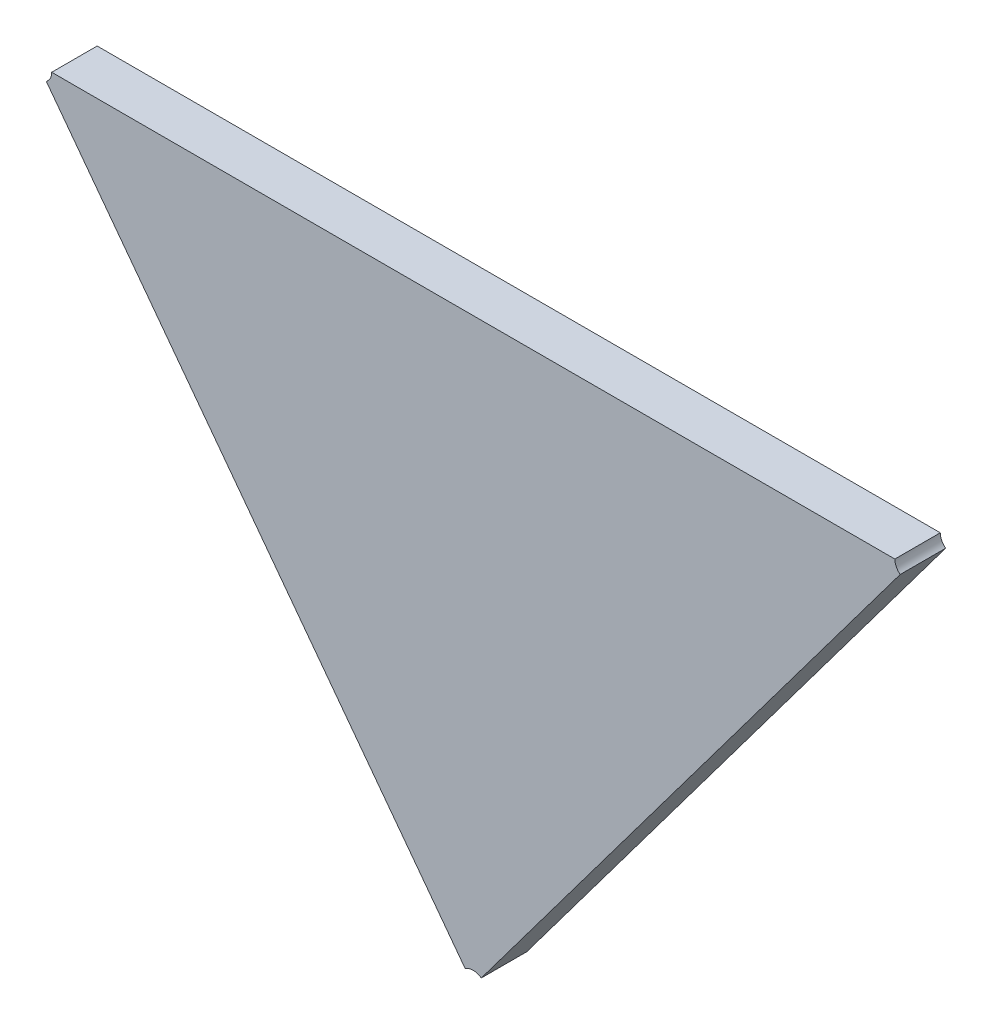
ISO-10303-21;
HEADER;
FILE_DESCRIPTION(('STEP AP214'),'2;1');
FILE_NAME('part.step','',(''),(''),'','','');
FILE_SCHEMA(('AUTOMOTIVE_DESIGN { 1 0 10303 214 1 1 1 1 }'));
ENDSEC;
DATA;
#1=APPLICATION_CONTEXT('core data for automotive mechanical design processes');
#2=APPLICATION_PROTOCOL_DEFINITION('international standard','automotive_design',2000,#1);
#3=PRODUCT_CONTEXT('',#1,'mechanical');
#4=PRODUCT('Part','Part','',(#3));
#5=PRODUCT_RELATED_PRODUCT_CATEGORY('part','',(#4));
#6=PRODUCT_DEFINITION_FORMATION('','',#4);
#7=PRODUCT_DEFINITION_CONTEXT('part definition',#1,'design');
#8=PRODUCT_DEFINITION('design','',#6,#7);
#9=PRODUCT_DEFINITION_SHAPE('','',#8);
#10=(LENGTH_UNIT() NAMED_UNIT(*) SI_UNIT(.MILLI.,.METRE.));
#11=(NAMED_UNIT(*) PLANE_ANGLE_UNIT() SI_UNIT($,.RADIAN.));
#12=(NAMED_UNIT(*) SI_UNIT($,.STERADIAN.) SOLID_ANGLE_UNIT());
#13=UNCERTAINTY_MEASURE_WITH_UNIT(LENGTH_MEASURE(1.E-05),#10,'distance_accuracy_value','');
#14=(GEOMETRIC_REPRESENTATION_CONTEXT(3) GLOBAL_UNCERTAINTY_ASSIGNED_CONTEXT((#13)) GLOBAL_UNIT_ASSIGNED_CONTEXT((#10,
#11,#12)) REPRESENTATION_CONTEXT('',''));
#15=CARTESIAN_POINT('',(0.,0.,0.));
#16=DIRECTION('',(0.,0.,1.));
#17=DIRECTION('',(1.,0.,0.));
#18=AXIS2_PLACEMENT_3D('',#15,#16,#17);
#19=CARTESIAN_POINT('',(-1.34299335690274,-1.32449342974732,0.0042));
#20=DIRECTION('',(0.,0.,1.));
#21=DIRECTION('',(1.,0.,0.));
#22=AXIS2_PLACEMENT_3D('',#19,#20,#21);
#23=PLANE('',#22);
#24=CARTESIAN_POINT('',(-1.37552796514819,-1.31090066755203,0.0042));
#25=DIRECTION('',(0.,0.,-1.));
#26=DIRECTION('',(1.,0.,0.));
#27=AXIS2_PLACEMENT_3D('',#24,#25,#26);
#28=CIRCLE('',#27,0.000999999999999994);
#29=CARTESIAN_POINT('',(-1.37452796514819,-1.31090066755203,0.0042));
#30=VERTEX_POINT('',#29);
#31=CARTESIAN_POINT('',(-1.37492823832534,-1.31170087236203,0.0042));
#32=VERTEX_POINT('',#31);
#33=EDGE_CURVE('E11',#30,#32,#28,.T.);
#34=ORIENTED_EDGE('',*,*,#33,.T.);
#35=DIRECTION('',(0.599726822848932,-0.800204810005242,0.));
#36=VECTOR('',#35,1.);
#37=CARTESIAN_POINT('',(-1.37492823832534,-1.31170087236203,0.0042));
#38=LINE('',#37,#36);
#39=CARTESIAN_POINT('',(-1.34359308372559,-1.3535108106167,0.0042));
#40=VERTEX_POINT('',#39);
#41=EDGE_CURVE('E114',#32,#40,#38,.T.);
#42=ORIENTED_EDGE('',*,*,#41,.T.);
#43=CARTESIAN_POINT('',(-1.34299335690274,-1.35431101542671,0.0042));
#44=DIRECTION('',(0.,0.,-1.));
#45=DIRECTION('',(-0.599726822847329,0.800204810006444,0.));
#46=AXIS2_PLACEMENT_3D('',#43,#44,#45);
#47=CIRCLE('',#46,0.00100000000000002);
#48=CARTESIAN_POINT('',(-1.34239363007989,-1.3535108106167,0.0042));
#49=VERTEX_POINT('',#48);
#50=EDGE_CURVE('E90',#40,#49,#47,.T.);
#51=ORIENTED_EDGE('',*,*,#50,.T.);
#52=DIRECTION('',(0.599726822848933,0.800204810005241,0.));
#53=VECTOR('',#52,1.);
#54=CARTESIAN_POINT('',(-1.34239363007989,-1.3535108106167,0.0042));
#55=LINE('',#54,#53);
#56=CARTESIAN_POINT('',(-1.31105847548013,-1.31170087236203,0.0042));
#57=VERTEX_POINT('',#56);
#58=EDGE_CURVE('E102',#49,#57,#55,.T.);
#59=ORIENTED_EDGE('',*,*,#58,.T.);
#60=CARTESIAN_POINT('',(-1.31045874865729,-1.31090066755203,0.0042));
#61=DIRECTION('',(0.,0.,-1.));
#62=DIRECTION('',(-0.599726822845659,-0.800204810007695,0.));
#63=AXIS2_PLACEMENT_3D('',#60,#61,#62);
#64=CIRCLE('',#63,0.00100000000000001);
#65=CARTESIAN_POINT('',(-1.31145874865729,-1.31090066755203,0.0042));
#66=VERTEX_POINT('',#65);
#67=EDGE_CURVE('E77',#57,#66,#64,.T.);
#68=ORIENTED_EDGE('',*,*,#67,.T.);
#69=DIRECTION('',(-1.,0.,0.));
#70=VECTOR('',#69,1.);
#71=CARTESIAN_POINT('',(-1.31145874865729,-1.31090066755203,0.0042));
#72=LINE('',#71,#70);
#73=EDGE_CURVE('E110',#66,#30,#72,.T.);
#74=ORIENTED_EDGE('',*,*,#73,.T.);
#75=EDGE_LOOP('',(#34,#42,#51,#59,#68,#74));
#76=FACE_BOUND('',#75,.T.);
#77=ADVANCED_FACE('F17',(#76),#23,.T.);
#78=CARTESIAN_POINT('',(-1.31045874865729,-1.31090066755203,0.0008));
#79=DIRECTION('',(0.,1.,0.));
#80=DIRECTION('',(-1.,0.,0.));
#81=AXIS2_PLACEMENT_3D('',#78,#79,#80);
#82=PLANE('',#81);
#83=DIRECTION('',(0.,0.,1.));
#84=VECTOR('',#83,1.);
#85=CARTESIAN_POINT('',(-1.37452796514819,-1.31090066755203,0.0008));
#86=LINE('',#85,#84);
#87=CARTESIAN_POINT('',(-1.37452796514819,-1.31090066755203,0.0008));
#88=VERTEX_POINT('',#87);
#89=EDGE_CURVE('E24',#88,#30,#86,.T.);
#90=ORIENTED_EDGE('',*,*,#89,.T.);
#91=ORIENTED_EDGE('',*,*,#73,.F.);
#92=DIRECTION('',(0.,0.,-1.));
#93=VECTOR('',#92,1.);
#94=CARTESIAN_POINT('',(-1.31145874865729,-1.31090066755203,0.0042));
#95=LINE('',#94,#93);
#96=CARTESIAN_POINT('',(-1.31145874865729,-1.31090066755203,0.0008));
#97=VERTEX_POINT('',#96);
#98=EDGE_CURVE('E104',#66,#97,#95,.T.);
#99=ORIENTED_EDGE('',*,*,#98,.T.);
#100=DIRECTION('',(-1.,0.,0.));
#101=VECTOR('',#100,1.);
#102=CARTESIAN_POINT('',(-1.31145874865729,-1.31090066755203,0.0008));
#103=LINE('',#102,#101);
#104=EDGE_CURVE('E99',#97,#88,#103,.T.);
#105=ORIENTED_EDGE('',*,*,#104,.T.);
#106=EDGE_LOOP('',(#90,#91,#99,#105));
#107=FACE_BOUND('',#106,.T.);
#108=ADVANCED_FACE('F120',(#107),#82,.T.);
#109=CARTESIAN_POINT('',(-1.34299335690274,-1.35431101542671,0.0008));
#110=DIRECTION('',(0.800204810005241,-0.599726822848934,0.));
#111=DIRECTION('',(0.599726822848934,0.800204810005241,0.));
#112=AXIS2_PLACEMENT_3D('',#109,#110,#111);
#113=PLANE('',#112);
#114=DIRECTION('',(0.,0.,-1.));
#115=VECTOR('',#114,1.);
#116=CARTESIAN_POINT('',(-1.34239363007989,-1.3535108106167,0.0042));
#117=LINE('',#116,#115);
#118=CARTESIAN_POINT('',(-1.34239363007989,-1.3535108106167,0.0008));
#119=VERTEX_POINT('',#118);
#120=EDGE_CURVE('E112',#49,#119,#117,.T.);
#121=ORIENTED_EDGE('',*,*,#120,.T.);
#122=DIRECTION('',(0.599726822848936,0.800204810005239,0.));
#123=VECTOR('',#122,1.);
#124=CARTESIAN_POINT('',(-1.34239363007989,-1.3535108106167,0.0008));
#125=LINE('',#124,#123);
#126=CARTESIAN_POINT('',(-1.31105847548013,-1.31170087236203,0.0008));
#127=VERTEX_POINT('',#126);
#128=EDGE_CURVE('E85',#119,#127,#125,.T.);
#129=ORIENTED_EDGE('',*,*,#128,.T.);
#130=DIRECTION('',(0.,0.,1.));
#131=VECTOR('',#130,1.);
#132=CARTESIAN_POINT('',(-1.31105847548013,-1.31170087236203,0.0008));
#133=LINE('',#132,#131);
#134=EDGE_CURVE('E96',#127,#57,#133,.T.);
#135=ORIENTED_EDGE('',*,*,#134,.T.);
#136=ORIENTED_EDGE('',*,*,#58,.F.);
#137=EDGE_LOOP('',(#121,#129,#135,#136));
#138=FACE_BOUND('',#137,.T.);
#139=ADVANCED_FACE('F127',(#138),#113,.T.);
#140=CARTESIAN_POINT('',(-1.3321500302078,-1.32718186406158,0.0008));
#141=DIRECTION('',(0.,0.,1.));
#142=DIRECTION('',(1.,0.,0.));
#143=AXIS2_PLACEMENT_3D('',#140,#141,#142);
#144=PLANE('',#143);
#145=CARTESIAN_POINT('',(-1.37552796514819,-1.31090066755203,0.0008));
#146=DIRECTION('',(0.,0.,1.));
#147=DIRECTION('',(0.599726822852127,-0.800204810002848,0.));
#148=AXIS2_PLACEMENT_3D('',#145,#146,#147);
#149=CIRCLE('',#148,0.000999999999999994);
#150=CARTESIAN_POINT('',(-1.37492823832534,-1.31170087236203,0.0008));
#151=VERTEX_POINT('',#150);
#152=EDGE_CURVE('E107',#151,#88,#149,.T.);
#153=ORIENTED_EDGE('',*,*,#152,.T.);
#154=ORIENTED_EDGE('',*,*,#104,.F.);
#155=CARTESIAN_POINT('',(-1.31045874865729,-1.31090066755203,0.0008));
#156=DIRECTION('',(0.,0.,1.));
#157=DIRECTION('',(-1.,0.,0.));
#158=AXIS2_PLACEMENT_3D('',#155,#156,#157);
#159=CIRCLE('',#158,0.00100000000000001);
#160=EDGE_CURVE('E78',#97,#127,#159,.T.);
#161=ORIENTED_EDGE('',*,*,#160,.T.);
#162=ORIENTED_EDGE('',*,*,#128,.F.);
#163=CARTESIAN_POINT('',(-1.34299335690274,-1.35431101542671,0.0008));
#164=DIRECTION('',(0.,0.,1.));
#165=DIRECTION('',(0.599726822847436,0.800204810006364,0.));
#166=AXIS2_PLACEMENT_3D('',#163,#164,#165);
#167=CIRCLE('',#166,0.00100000000000002);
#168=CARTESIAN_POINT('',(-1.34359308372559,-1.3535108106167,0.0008));
#169=VERTEX_POINT('',#168);
#170=EDGE_CURVE('E82',#119,#169,#167,.T.);
#171=ORIENTED_EDGE('',*,*,#170,.T.);
#172=DIRECTION('',(-0.59972682284893,0.800204810005244,0.));
#173=VECTOR('',#172,1.);
#174=CARTESIAN_POINT('',(-1.34359308372559,-1.3535108106167,0.0008));
#175=LINE('',#174,#173);
#176=EDGE_CURVE('E67',#169,#151,#175,.T.);
#177=ORIENTED_EDGE('',*,*,#176,.T.);
#178=EDGE_LOOP('',(#153,#154,#161,#162,#171,#177));
#179=FACE_BOUND('',#178,.T.);
#180=ADVANCED_FACE('F83',(#179),#144,.F.);
#181=CARTESIAN_POINT('',(-1.34299335690274,-1.35431101542671,0.0008));
#182=DIRECTION('',(0.800204810005241,0.599726822848934,0.));
#183=DIRECTION('',(-0.599726822848934,0.800204810005241,0.));
#184=AXIS2_PLACEMENT_3D('',#181,#182,#183);
#185=PLANE('',#184);
#186=DIRECTION('',(0.,0.,1.));
#187=VECTOR('',#186,1.);
#188=CARTESIAN_POINT('',(-1.37492823832534,-1.31170087236203,0.0008));
#189=LINE('',#188,#187);
#190=EDGE_CURVE('E74',#151,#32,#189,.T.);
#191=ORIENTED_EDGE('',*,*,#190,.F.);
#192=ORIENTED_EDGE('',*,*,#176,.F.);
#193=DIRECTION('',(0.,0.,1.));
#194=VECTOR('',#193,1.);
#195=CARTESIAN_POINT('',(-1.34359308372559,-1.3535108106167,0.0008));
#196=LINE('',#195,#194);
#197=EDGE_CURVE('E71',#169,#40,#196,.T.);
#198=ORIENTED_EDGE('',*,*,#197,.T.);
#199=ORIENTED_EDGE('',*,*,#41,.F.);
#200=EDGE_LOOP('',(#191,#192,#198,#199));
#201=FACE_BOUND('',#200,.T.);
#202=ADVANCED_FACE('F69',(#201),#185,.F.);
#203=CARTESIAN_POINT('',(-1.31045874865729,-1.31090066755203,0.0012));
#204=DIRECTION('',(0.,0.,1.));
#205=DIRECTION('',(-1.,0.,0.));
#206=AXIS2_PLACEMENT_3D('',#203,#204,#205);
#207=CYLINDRICAL_SURFACE('',#206,0.00100000000000001);
#208=ORIENTED_EDGE('',*,*,#98,.F.);
#209=ORIENTED_EDGE('',*,*,#67,.F.);
#210=ORIENTED_EDGE('',*,*,#134,.F.);
#211=ORIENTED_EDGE('',*,*,#160,.F.);
#212=EDGE_LOOP('',(#208,#209,#210,#211));
#213=FACE_BOUND('',#212,.T.);
#214=ADVANCED_FACE('F124',(#213),#207,.F.);
#215=CARTESIAN_POINT('',(-1.34299335690274,-1.35431101542671,0.0012));
#216=DIRECTION('',(0.,0.,1.));
#217=DIRECTION('',(-1.,0.,0.));
#218=AXIS2_PLACEMENT_3D('',#215,#216,#217);
#219=CYLINDRICAL_SURFACE('',#218,0.00100000000000002);
#220=ORIENTED_EDGE('',*,*,#120,.F.);
#221=ORIENTED_EDGE('',*,*,#50,.F.);
#222=ORIENTED_EDGE('',*,*,#197,.F.);
#223=ORIENTED_EDGE('',*,*,#170,.F.);
#224=EDGE_LOOP('',(#220,#221,#222,#223));
#225=FACE_BOUND('',#224,.T.);
#226=ADVANCED_FACE('F89',(#225),#219,.F.);
#227=CARTESIAN_POINT('',(-1.37552796514819,-1.31090066755203,0.0012));
#228=DIRECTION('',(0.,0.,1.));
#229=DIRECTION('',(-1.,0.,0.));
#230=AXIS2_PLACEMENT_3D('',#227,#228,#229);
#231=CYLINDRICAL_SURFACE('',#230,0.000999999999999994);
#232=ORIENTED_EDGE('',*,*,#89,.F.);
#233=ORIENTED_EDGE('',*,*,#152,.F.);
#234=ORIENTED_EDGE('',*,*,#190,.T.);
#235=ORIENTED_EDGE('',*,*,#33,.F.);
#236=EDGE_LOOP('',(#232,#233,#234,#235));
#237=FACE_BOUND('',#236,.T.);
#238=ADVANCED_FACE('F117',(#237),#231,.F.);
#239=CLOSED_SHELL('',(#77,#108,#139,#180,#202,#214,#226,#238));
#240=MANIFOLD_SOLID_BREP('B1',#239);
#241=ADVANCED_BREP_SHAPE_REPRESENTATION('',(#18,#240),#14);
#242=SHAPE_DEFINITION_REPRESENTATION(#9,#241);
ENDSEC;
END-ISO-10303-21;
